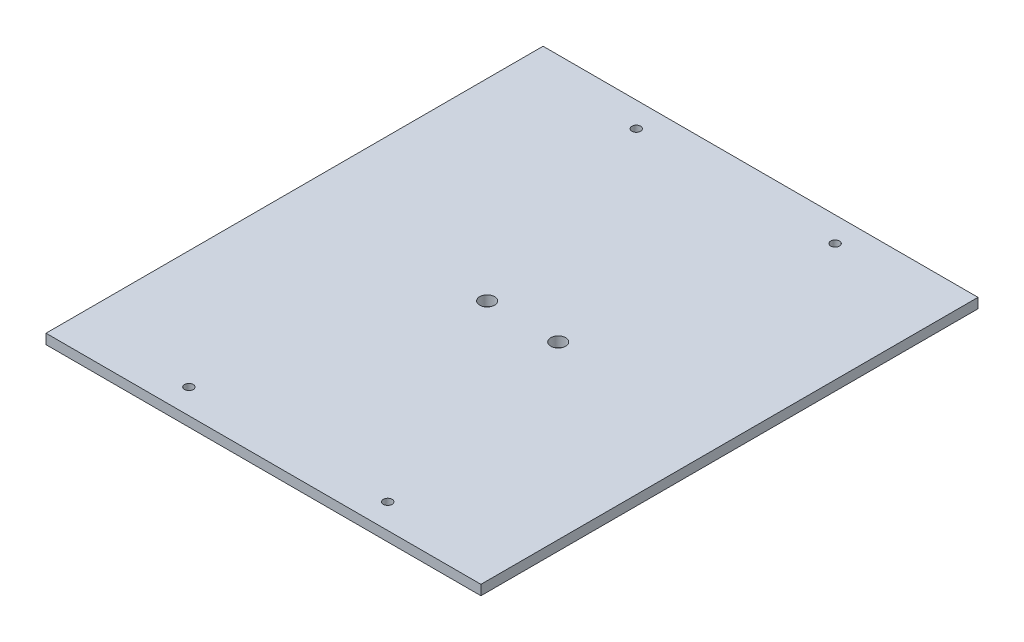
ISO-10303-21;
HEADER;
FILE_DESCRIPTION(('STEP AP214'),'2;1');
FILE_NAME('part.step','',(''),(''),'','','');
FILE_SCHEMA(('AUTOMOTIVE_DESIGN { 1 0 10303 214 1 1 1 1 }'));
ENDSEC;
DATA;
#1=APPLICATION_CONTEXT('core data for automotive mechanical design processes');
#2=APPLICATION_PROTOCOL_DEFINITION('international standard','automotive_design',2000,#1);
#3=PRODUCT_CONTEXT('',#1,'mechanical');
#4=PRODUCT('Part','Part','',(#3));
#5=PRODUCT_RELATED_PRODUCT_CATEGORY('part','',(#4));
#6=PRODUCT_DEFINITION_FORMATION('','',#4);
#7=PRODUCT_DEFINITION_CONTEXT('part definition',#1,'design');
#8=PRODUCT_DEFINITION('design','',#6,#7);
#9=PRODUCT_DEFINITION_SHAPE('','',#8);
#10=(LENGTH_UNIT() NAMED_UNIT(*) SI_UNIT(.MILLI.,.METRE.));
#11=(NAMED_UNIT(*) PLANE_ANGLE_UNIT() SI_UNIT($,.RADIAN.));
#12=(NAMED_UNIT(*) SI_UNIT($,.STERADIAN.) SOLID_ANGLE_UNIT());
#13=UNCERTAINTY_MEASURE_WITH_UNIT(LENGTH_MEASURE(1.E-05),#10,'distance_accuracy_value','');
#14=(GEOMETRIC_REPRESENTATION_CONTEXT(3) GLOBAL_UNCERTAINTY_ASSIGNED_CONTEXT((#13)) GLOBAL_UNIT_ASSIGNED_CONTEXT((#10,
#11,#12)) REPRESENTATION_CONTEXT('',''));
#15=CARTESIAN_POINT('',(0.,0.,0.));
#16=DIRECTION('',(0.,0.,1.));
#17=DIRECTION('',(1.,0.,0.));
#18=AXIS2_PLACEMENT_3D('',#15,#16,#17);
#19=CARTESIAN_POINT('',(111.125,5.08,127.));
#20=DIRECTION('',(-1.,0.,0.));
#21=DIRECTION('',(0.,0.,1.));
#22=AXIS2_PLACEMENT_3D('',#19,#20,#21);
#23=PLANE('',#22);
#24=DIRECTION('',(0.,0.,-1.));
#25=VECTOR('',#24,1.);
#26=CARTESIAN_POINT('',(111.125,0.,127.));
#27=LINE('',#26,#25);
#28=CARTESIAN_POINT('',(111.125,0.,127.));
#29=VERTEX_POINT('',#28);
#30=CARTESIAN_POINT('',(111.125,0.,-127.));
#31=VERTEX_POINT('',#30);
#32=EDGE_CURVE('E130',#29,#31,#27,.T.);
#33=ORIENTED_EDGE('',*,*,#32,.T.);
#34=DIRECTION('',(0.,-1.,0.));
#35=VECTOR('',#34,1.);
#36=CARTESIAN_POINT('',(111.125,5.08,-127.));
#37=LINE('',#36,#35);
#38=CARTESIAN_POINT('',(111.125,5.08,-127.));
#39=VERTEX_POINT('',#38);
#40=EDGE_CURVE('E12',#39,#31,#37,.T.);
#41=ORIENTED_EDGE('',*,*,#40,.F.);
#42=DIRECTION('',(0.,0.,-1.));
#43=VECTOR('',#42,1.);
#44=CARTESIAN_POINT('',(111.125,5.08,127.));
#45=LINE('',#44,#43);
#46=CARTESIAN_POINT('',(111.125,5.08,127.));
#47=VERTEX_POINT('',#46);
#48=EDGE_CURVE('E89',#47,#39,#45,.T.);
#49=ORIENTED_EDGE('',*,*,#48,.F.);
#50=DIRECTION('',(0.,-1.,0.));
#51=VECTOR('',#50,1.);
#52=CARTESIAN_POINT('',(111.125,5.08,127.));
#53=LINE('',#52,#51);
#54=EDGE_CURVE('E100',#47,#29,#53,.T.);
#55=ORIENTED_EDGE('',*,*,#54,.T.);
#56=EDGE_LOOP('',(#33,#41,#49,#55));
#57=FACE_BOUND('',#56,.T.);
#58=ADVANCED_FACE('F38',(#57),#23,.F.);
#59=CARTESIAN_POINT('',(-111.125,5.08,-127.));
#60=DIRECTION('',(0.,0.,1.));
#61=DIRECTION('',(1.,0.,0.));
#62=AXIS2_PLACEMENT_3D('',#59,#60,#61);
#63=PLANE('',#62);
#64=DIRECTION('',(-1.,0.,0.));
#65=VECTOR('',#64,1.);
#66=CARTESIAN_POINT('',(-111.125,0.,-127.));
#67=LINE('',#66,#65);
#68=CARTESIAN_POINT('',(-111.125,0.,-127.));
#69=VERTEX_POINT('',#68);
#70=EDGE_CURVE('E94',#31,#69,#67,.T.);
#71=ORIENTED_EDGE('',*,*,#70,.T.);
#72=DIRECTION('',(0.,-1.,0.));
#73=VECTOR('',#72,1.);
#74=CARTESIAN_POINT('',(-111.125,5.08,-127.));
#75=LINE('',#74,#73);
#76=CARTESIAN_POINT('',(-111.125,5.08,-127.));
#77=VERTEX_POINT('',#76);
#78=EDGE_CURVE('E46',#77,#69,#75,.T.);
#79=ORIENTED_EDGE('',*,*,#78,.F.);
#80=DIRECTION('',(-1.,0.,0.));
#81=VECTOR('',#80,1.);
#82=CARTESIAN_POINT('',(-111.125,5.08,-127.));
#83=LINE('',#82,#81);
#84=EDGE_CURVE('E84',#39,#77,#83,.T.);
#85=ORIENTED_EDGE('',*,*,#84,.F.);
#86=ORIENTED_EDGE('',*,*,#40,.T.);
#87=EDGE_LOOP('',(#71,#79,#85,#86));
#88=FACE_BOUND('',#87,.T.);
#89=ADVANCED_FACE('F93',(#88),#63,.F.);
#90=CARTESIAN_POINT('',(-111.125,5.08,127.));
#91=DIRECTION('',(1.,0.,0.));
#92=DIRECTION('',(0.,0.,-1.));
#93=AXIS2_PLACEMENT_3D('',#90,#91,#92);
#94=PLANE('',#93);
#95=DIRECTION('',(0.,0.,1.));
#96=VECTOR('',#95,1.);
#97=CARTESIAN_POINT('',(-111.125,0.,127.));
#98=LINE('',#97,#96);
#99=CARTESIAN_POINT('',(-111.125,0.,127.));
#100=VERTEX_POINT('',#99);
#101=EDGE_CURVE('E71',#69,#100,#98,.T.);
#102=ORIENTED_EDGE('',*,*,#101,.T.);
#103=DIRECTION('',(0.,-1.,0.));
#104=VECTOR('',#103,1.);
#105=CARTESIAN_POINT('',(-111.125,5.08,127.));
#106=LINE('',#105,#104);
#107=CARTESIAN_POINT('',(-111.125,5.08,127.));
#108=VERTEX_POINT('',#107);
#109=EDGE_CURVE('E95',#108,#100,#106,.T.);
#110=ORIENTED_EDGE('',*,*,#109,.F.);
#111=DIRECTION('',(0.,0.,1.));
#112=VECTOR('',#111,1.);
#113=CARTESIAN_POINT('',(-111.125,5.08,127.));
#114=LINE('',#113,#112);
#115=EDGE_CURVE('E87',#77,#108,#114,.T.);
#116=ORIENTED_EDGE('',*,*,#115,.F.);
#117=ORIENTED_EDGE('',*,*,#78,.T.);
#118=EDGE_LOOP('',(#102,#110,#116,#117));
#119=FACE_BOUND('',#118,.T.);
#120=ADVANCED_FACE('F96',(#119),#94,.F.);
#121=CARTESIAN_POINT('',(-111.125,5.08,127.));
#122=DIRECTION('',(0.,0.,-1.));
#123=DIRECTION('',(-1.,0.,0.));
#124=AXIS2_PLACEMENT_3D('',#121,#122,#123);
#125=PLANE('',#124);
#126=DIRECTION('',(1.,0.,0.));
#127=VECTOR('',#126,1.);
#128=CARTESIAN_POINT('',(-111.125,0.,127.));
#129=LINE('',#128,#127);
#130=EDGE_CURVE('E77',#100,#29,#129,.T.);
#131=ORIENTED_EDGE('',*,*,#130,.T.);
#132=ORIENTED_EDGE('',*,*,#54,.F.);
#133=DIRECTION('',(1.,0.,0.));
#134=VECTOR('',#133,1.);
#135=CARTESIAN_POINT('',(-111.125,5.08,127.));
#136=LINE('',#135,#134);
#137=EDGE_CURVE('E54',#108,#47,#136,.T.);
#138=ORIENTED_EDGE('',*,*,#137,.F.);
#139=ORIENTED_EDGE('',*,*,#109,.T.);
#140=EDGE_LOOP('',(#131,#132,#138,#139));
#141=FACE_BOUND('',#140,.T.);
#142=ADVANCED_FACE('F183',(#141),#125,.F.);
#143=CARTESIAN_POINT('',(0.,5.08,0.));
#144=DIRECTION('',(0.,-1.,0.));
#145=DIRECTION('',(0.,0.,-1.));
#146=AXIS2_PLACEMENT_3D('',#143,#144,#145);
#147=PLANE('',#146);
#148=CARTESIAN_POINT('',(-50.8,5.08,114.3));
#149=DIRECTION('',(0.,-1.,0.));
#150=DIRECTION('',(0.,0.,-1.));
#151=AXIS2_PLACEMENT_3D('',#148,#149,#150);
#152=CIRCLE('',#151,2.2479);
#153=CARTESIAN_POINT('',(-50.8,5.08,112.0521));
#154=VERTEX_POINT('',#153);
#155=EDGE_CURVE('E259',#154,#154,#152,.T.);
#156=ORIENTED_EDGE('',*,*,#155,.T.);
#157=EDGE_LOOP('',(#156));
#158=FACE_BOUND('',#157,.T.);
#159=CARTESIAN_POINT('',(50.8,5.08,114.3));
#160=DIRECTION('',(0.,-1.,0.));
#161=DIRECTION('',(0.,0.,-1.));
#162=AXIS2_PLACEMENT_3D('',#159,#160,#161);
#163=CIRCLE('',#162,2.2479);
#164=CARTESIAN_POINT('',(50.8,5.08,112.0521));
#165=VERTEX_POINT('',#164);
#166=EDGE_CURVE('E269',#165,#165,#163,.T.);
#167=ORIENTED_EDGE('',*,*,#166,.T.);
#168=EDGE_LOOP('',(#167));
#169=FACE_BOUND('',#168,.T.);
#170=CARTESIAN_POINT('',(50.8,5.08,-114.3));
#171=DIRECTION('',(0.,-1.,0.));
#172=DIRECTION('',(0.,0.,-1.));
#173=AXIS2_PLACEMENT_3D('',#170,#171,#172);
#174=CIRCLE('',#173,2.2479);
#175=CARTESIAN_POINT('',(50.8,5.08,-116.5479));
#176=VERTEX_POINT('',#175);
#177=EDGE_CURVE('E139',#176,#176,#174,.T.);
#178=ORIENTED_EDGE('',*,*,#177,.T.);
#179=EDGE_LOOP('',(#178));
#180=FACE_BOUND('',#179,.T.);
#181=CARTESIAN_POINT('',(-50.8,5.08,-114.3));
#182=DIRECTION('',(0.,-1.,0.));
#183=DIRECTION('',(0.,0.,-1.));
#184=AXIS2_PLACEMENT_3D('',#181,#182,#183);
#185=CIRCLE('',#184,2.2479);
#186=CARTESIAN_POINT('',(-50.8,5.08,-116.5479));
#187=VERTEX_POINT('',#186);
#188=EDGE_CURVE('E117',#187,#187,#185,.T.);
#189=ORIENTED_EDGE('',*,*,#188,.T.);
#190=EDGE_LOOP('',(#189));
#191=FACE_BOUND('',#190,.T.);
#192=CARTESIAN_POINT('',(-12.7,5.08,0.));
#193=DIRECTION('',(0.,1.,0.));
#194=DIRECTION('',(0.,0.,1.));
#195=AXIS2_PLACEMENT_3D('',#192,#193,#194);
#196=CIRCLE('',#195,3.81);
#197=CARTESIAN_POINT('',(-12.7,5.08,3.81));
#198=VERTEX_POINT('',#197);
#199=EDGE_CURVE('E125',#198,#198,#196,.T.);
#200=ORIENTED_EDGE('',*,*,#199,.F.);
#201=EDGE_LOOP('',(#200));
#202=FACE_BOUND('',#201,.T.);
#203=CARTESIAN_POINT('',(23.622,5.08,0.));
#204=DIRECTION('',(0.,1.,0.));
#205=DIRECTION('',(0.,0.,1.));
#206=AXIS2_PLACEMENT_3D('',#203,#204,#205);
#207=CIRCLE('',#206,3.81);
#208=CARTESIAN_POINT('',(23.622,5.08,3.81));
#209=VERTEX_POINT('',#208);
#210=EDGE_CURVE('E116',#209,#209,#207,.T.);
#211=ORIENTED_EDGE('',*,*,#210,.F.);
#212=EDGE_LOOP('',(#211));
#213=FACE_BOUND('',#212,.T.);
#214=ORIENTED_EDGE('',*,*,#48,.T.);
#215=ORIENTED_EDGE('',*,*,#84,.T.);
#216=ORIENTED_EDGE('',*,*,#115,.T.);
#217=ORIENTED_EDGE('',*,*,#137,.T.);
#218=EDGE_LOOP('',(#214,#215,#216,#217));
#219=FACE_BOUND('',#218,.T.);
#220=ADVANCED_FACE('F85',(#158,#169,#180,#191,#202,#213,#219),#147,.F.);
#221=CARTESIAN_POINT('',(0.,0.,0.));
#222=DIRECTION('',(0.,-1.,0.));
#223=DIRECTION('',(0.,0.,-1.));
#224=AXIS2_PLACEMENT_3D('',#221,#222,#223);
#225=PLANE('',#224);
#226=CARTESIAN_POINT('',(-50.8,0.,114.3));
#227=DIRECTION('',(0.,-1.,0.));
#228=DIRECTION('',(0.,0.,-1.));
#229=AXIS2_PLACEMENT_3D('',#226,#227,#228);
#230=CIRCLE('',#229,2.2479);
#231=CARTESIAN_POINT('',(-50.8,0.,112.0521));
#232=VERTEX_POINT('',#231);
#233=EDGE_CURVE('E261',#232,#232,#230,.T.);
#234=ORIENTED_EDGE('',*,*,#233,.F.);
#235=EDGE_LOOP('',(#234));
#236=FACE_BOUND('',#235,.T.);
#237=CARTESIAN_POINT('',(50.8,0.,114.3));
#238=DIRECTION('',(0.,-1.,0.));
#239=DIRECTION('',(0.,0.,-1.));
#240=AXIS2_PLACEMENT_3D('',#237,#238,#239);
#241=CIRCLE('',#240,2.2479);
#242=CARTESIAN_POINT('',(50.8,0.,112.0521));
#243=VERTEX_POINT('',#242);
#244=EDGE_CURVE('E264',#243,#243,#241,.T.);
#245=ORIENTED_EDGE('',*,*,#244,.F.);
#246=EDGE_LOOP('',(#245));
#247=FACE_BOUND('',#246,.T.);
#248=CARTESIAN_POINT('',(50.8,0.,-114.3));
#249=DIRECTION('',(0.,-1.,0.));
#250=DIRECTION('',(0.,0.,-1.));
#251=AXIS2_PLACEMENT_3D('',#248,#249,#250);
#252=CIRCLE('',#251,2.2479);
#253=CARTESIAN_POINT('',(50.8,0.,-116.5479));
#254=VERTEX_POINT('',#253);
#255=EDGE_CURVE('E145',#254,#254,#252,.T.);
#256=ORIENTED_EDGE('',*,*,#255,.F.);
#257=EDGE_LOOP('',(#256));
#258=FACE_BOUND('',#257,.T.);
#259=CARTESIAN_POINT('',(-50.8,0.,-114.3));
#260=DIRECTION('',(0.,-1.,0.));
#261=DIRECTION('',(0.,0.,-1.));
#262=AXIS2_PLACEMENT_3D('',#259,#260,#261);
#263=CIRCLE('',#262,2.2479);
#264=CARTESIAN_POINT('',(-50.8,0.,-116.5479));
#265=VERTEX_POINT('',#264);
#266=EDGE_CURVE('E144',#265,#265,#263,.T.);
#267=ORIENTED_EDGE('',*,*,#266,.F.);
#268=EDGE_LOOP('',(#267));
#269=FACE_BOUND('',#268,.T.);
#270=CARTESIAN_POINT('',(-12.7,0.,0.));
#271=DIRECTION('',(0.,1.,0.));
#272=DIRECTION('',(0.,0.,1.));
#273=AXIS2_PLACEMENT_3D('',#270,#271,#272);
#274=CIRCLE('',#273,3.81);
#275=CARTESIAN_POINT('',(-12.7,0.,3.81));
#276=VERTEX_POINT('',#275);
#277=EDGE_CURVE('E122',#276,#276,#274,.T.);
#278=ORIENTED_EDGE('',*,*,#277,.T.);
#279=EDGE_LOOP('',(#278));
#280=FACE_BOUND('',#279,.T.);
#281=CARTESIAN_POINT('',(23.622,0.,0.));
#282=DIRECTION('',(0.,1.,0.));
#283=DIRECTION('',(0.,0.,1.));
#284=AXIS2_PLACEMENT_3D('',#281,#282,#283);
#285=CIRCLE('',#284,3.81);
#286=CARTESIAN_POINT('',(23.622,0.,3.81));
#287=VERTEX_POINT('',#286);
#288=EDGE_CURVE('E114',#287,#287,#285,.T.);
#289=ORIENTED_EDGE('',*,*,#288,.T.);
#290=EDGE_LOOP('',(#289));
#291=FACE_BOUND('',#290,.T.);
#292=ORIENTED_EDGE('',*,*,#32,.F.);
#293=ORIENTED_EDGE('',*,*,#130,.F.);
#294=ORIENTED_EDGE('',*,*,#101,.F.);
#295=ORIENTED_EDGE('',*,*,#70,.F.);
#296=EDGE_LOOP('',(#292,#293,#294,#295));
#297=FACE_BOUND('',#296,.T.);
#298=ADVANCED_FACE('F184',(#236,#247,#258,#269,#280,#291,#297),#225,.T.);
#299=CARTESIAN_POINT('',(23.622,5.08,0.));
#300=DIRECTION('',(0.,-1.,0.));
#301=DIRECTION('',(0.,0.,-1.));
#302=AXIS2_PLACEMENT_3D('',#299,#300,#301);
#303=CYLINDRICAL_SURFACE('',#302,3.81);
#304=ORIENTED_EDGE('',*,*,#210,.T.);
#305=EDGE_LOOP('',(#304));
#306=FACE_BOUND('',#305,.T.);
#307=ORIENTED_EDGE('',*,*,#288,.F.);
#308=EDGE_LOOP('',(#307));
#309=FACE_BOUND('',#308,.T.);
#310=ADVANCED_FACE('F167',(#306,#309),#303,.F.);
#311=CARTESIAN_POINT('',(-12.7,5.08,0.));
#312=DIRECTION('',(0.,-1.,0.));
#313=DIRECTION('',(0.,0.,-1.));
#314=AXIS2_PLACEMENT_3D('',#311,#312,#313);
#315=CYLINDRICAL_SURFACE('',#314,3.81);
#316=ORIENTED_EDGE('',*,*,#199,.T.);
#317=EDGE_LOOP('',(#316));
#318=FACE_BOUND('',#317,.T.);
#319=ORIENTED_EDGE('',*,*,#277,.F.);
#320=EDGE_LOOP('',(#319));
#321=FACE_BOUND('',#320,.T.);
#322=ADVANCED_FACE('F158',(#318,#321),#315,.F.);
#323=CARTESIAN_POINT('',(-50.8,0.,-114.3));
#324=DIRECTION('',(0.,-1.,0.));
#325=DIRECTION('',(0.,0.,-1.));
#326=AXIS2_PLACEMENT_3D('',#323,#324,#325);
#327=CYLINDRICAL_SURFACE('',#326,2.2479);
#328=ORIENTED_EDGE('',*,*,#188,.F.);
#329=EDGE_LOOP('',(#328));
#330=FACE_BOUND('',#329,.T.);
#331=ORIENTED_EDGE('',*,*,#266,.T.);
#332=EDGE_LOOP('',(#331));
#333=FACE_BOUND('',#332,.T.);
#334=ADVANCED_FACE('F155',(#330,#333),#327,.F.);
#335=CARTESIAN_POINT('',(50.8,0.,-114.3));
#336=DIRECTION('',(0.,-1.,0.));
#337=DIRECTION('',(0.,0.,-1.));
#338=AXIS2_PLACEMENT_3D('',#335,#336,#337);
#339=CYLINDRICAL_SURFACE('',#338,2.2479);
#340=ORIENTED_EDGE('',*,*,#177,.F.);
#341=EDGE_LOOP('',(#340));
#342=FACE_BOUND('',#341,.T.);
#343=ORIENTED_EDGE('',*,*,#255,.T.);
#344=EDGE_LOOP('',(#343));
#345=FACE_BOUND('',#344,.T.);
#346=ADVANCED_FACE('F157',(#342,#345),#339,.F.);
#347=CARTESIAN_POINT('',(50.8,0.,114.3));
#348=DIRECTION('',(0.,-1.,0.));
#349=DIRECTION('',(0.,0.,-1.));
#350=AXIS2_PLACEMENT_3D('',#347,#348,#349);
#351=CYLINDRICAL_SURFACE('',#350,2.2479);
#352=ORIENTED_EDGE('',*,*,#166,.F.);
#353=EDGE_LOOP('',(#352));
#354=FACE_BOUND('',#353,.T.);
#355=ORIENTED_EDGE('',*,*,#244,.T.);
#356=EDGE_LOOP('',(#355));
#357=FACE_BOUND('',#356,.T.);
#358=ADVANCED_FACE('F164',(#354,#357),#351,.F.);
#359=CARTESIAN_POINT('',(-50.8,0.,114.3));
#360=DIRECTION('',(0.,-1.,0.));
#361=DIRECTION('',(0.,0.,-1.));
#362=AXIS2_PLACEMENT_3D('',#359,#360,#361);
#363=CYLINDRICAL_SURFACE('',#362,2.2479);
#364=ORIENTED_EDGE('',*,*,#155,.F.);
#365=EDGE_LOOP('',(#364));
#366=FACE_BOUND('',#365,.T.);
#367=ORIENTED_EDGE('',*,*,#233,.T.);
#368=EDGE_LOOP('',(#367));
#369=FACE_BOUND('',#368,.T.);
#370=ADVANCED_FACE('F242',(#366,#369),#363,.F.);
#371=CLOSED_SHELL('',(#58,#89,#120,#142,#220,#298,#310,#322,#334,#346,#358,#370));
#372=MANIFOLD_SOLID_BREP('B2',#371);
#373=ADVANCED_BREP_SHAPE_REPRESENTATION('',(#18,#372),#14);
#374=SHAPE_DEFINITION_REPRESENTATION(#9,#373);
ENDSEC;
END-ISO-10303-21;
